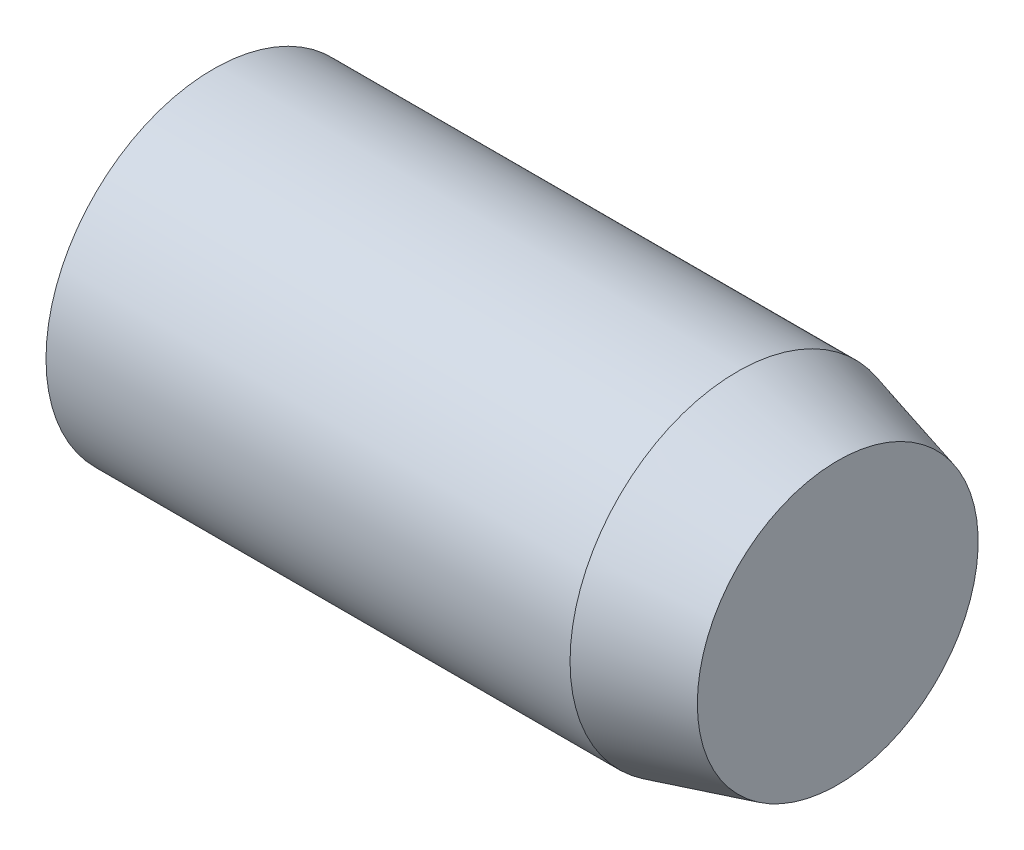
ISO-10303-21;
HEADER;
FILE_DESCRIPTION(('STEP AP214'),'2;1');
FILE_NAME('part.step','',(''),(''),'','','');
FILE_SCHEMA(('AUTOMOTIVE_DESIGN { 1 0 10303 214 1 1 1 1 }'));
ENDSEC;
DATA;
#1=APPLICATION_CONTEXT('core data for automotive mechanical design processes');
#2=APPLICATION_PROTOCOL_DEFINITION('international standard','automotive_design',2000,#1);
#3=PRODUCT_CONTEXT('',#1,'mechanical');
#4=PRODUCT('Part','Part','',(#3));
#5=PRODUCT_RELATED_PRODUCT_CATEGORY('part','',(#4));
#6=PRODUCT_DEFINITION_FORMATION('','',#4);
#7=PRODUCT_DEFINITION_CONTEXT('part definition',#1,'design');
#8=PRODUCT_DEFINITION('design','',#6,#7);
#9=PRODUCT_DEFINITION_SHAPE('','',#8);
#10=(LENGTH_UNIT() NAMED_UNIT(*) SI_UNIT(.MILLI.,.METRE.));
#11=(NAMED_UNIT(*) PLANE_ANGLE_UNIT() SI_UNIT($,.RADIAN.));
#12=(NAMED_UNIT(*) SI_UNIT($,.STERADIAN.) SOLID_ANGLE_UNIT());
#13=UNCERTAINTY_MEASURE_WITH_UNIT(LENGTH_MEASURE(1.E-05),#10,'distance_accuracy_value','');
#14=(GEOMETRIC_REPRESENTATION_CONTEXT(3) GLOBAL_UNCERTAINTY_ASSIGNED_CONTEXT((#13)) GLOBAL_UNIT_ASSIGNED_CONTEXT((#10,
#11,#12)) REPRESENTATION_CONTEXT('',''));
#15=CARTESIAN_POINT('',(0.,0.,0.));
#16=DIRECTION('',(0.,0.,1.));
#17=DIRECTION('',(1.,0.,0.));
#18=AXIS2_PLACEMENT_3D('',#15,#16,#17);
#19=CARTESIAN_POINT('',(0.,0.,0.));
#20=DIRECTION('',(-1.,0.,0.));
#21=DIRECTION('',(0.,0.,1.));
#22=AXIS2_PLACEMENT_3D('',#19,#20,#21);
#23=PLANE('',#22);
#24=CARTESIAN_POINT('',(0.,0.,0.));
#25=DIRECTION('',(-1.,0.,0.));
#26=DIRECTION('',(0.,0.,1.));
#27=AXIS2_PLACEMENT_3D('',#24,#25,#26);
#28=CIRCLE('',#27,2.09807621132745);
#29=CARTESIAN_POINT('',(0.,0.,2.09807621132745));
#30=VERTEX_POINT('',#29);
#31=EDGE_CURVE('E19',#30,#30,#28,.T.);
#32=ORIENTED_EDGE('',*,*,#31,.F.);
#33=EDGE_LOOP('',(#32));
#34=FACE_BOUND('',#33,.T.);
#35=ADVANCED_FACE('F16',(#34),#23,.F.);
#36=CARTESIAN_POINT('',(-1.49999999990769,0.,0.));
#37=DIRECTION('',(-1.,0.,0.));
#38=DIRECTION('',(0.,0.,1.));
#39=AXIS2_PLACEMENT_3D('',#36,#37,#38);
#40=CONICAL_SURFACE('',#39,2.4999999999693,0.261799387811533);
#41=CARTESIAN_POINT('',(-1.49999999999997,0.,0.));
#42=DIRECTION('',(-1.,0.,0.));
#43=DIRECTION('',(0.,0.,1.));
#44=AXIS2_PLACEMENT_3D('',#41,#42,#43);
#45=CIRCLE('',#44,2.5);
#46=CARTESIAN_POINT('',(-1.49999999999997,0.,2.5));
#47=VERTEX_POINT('',#46);
#48=EDGE_CURVE('E24',#47,#47,#45,.T.);
#49=ORIENTED_EDGE('',*,*,#48,.F.);
#50=EDGE_LOOP('',(#49));
#51=FACE_BOUND('',#50,.T.);
#52=ORIENTED_EDGE('',*,*,#31,.T.);
#53=EDGE_LOOP('',(#52));
#54=FACE_BOUND('',#53,.T.);
#55=ADVANCED_FACE('F37',(#51,#54),#40,.T.);
#56=CARTESIAN_POINT('',(-5.,0.,0.));
#57=DIRECTION('',(0.,1.,0.));
#58=DIRECTION('',(1.,0.,0.));
#59=AXIS2_PLACEMENT_3D('',#56,#57,#58);
#60=SPHERICAL_SURFACE('',#59,5.);
#61=CARTESIAN_POINT('',(-9.33012701892219,0.,0.));
#62=DIRECTION('',(-1.,0.,0.));
#63=DIRECTION('',(0.,0.,1.));
#64=AXIS2_PLACEMENT_3D('',#61,#62,#63);
#65=CIRCLE('',#64,2.5);
#66=CARTESIAN_POINT('',(-9.33012701892219,0.,2.5));
#67=VERTEX_POINT('',#66);
#68=EDGE_CURVE('E10',#67,#67,#65,.F.);
#69=ORIENTED_EDGE('',*,*,#68,.F.);
#70=EDGE_LOOP('',(#69));
#71=FACE_BOUND('',#70,.T.);
#72=ADVANCED_FACE('F33',(#71),#60,.T.);
#73=CARTESIAN_POINT('',(-60.0052434362964,0.,0.));
#74=DIRECTION('',(-1.,0.,0.));
#75=DIRECTION('',(0.,0.,1.));
#76=AXIS2_PLACEMENT_3D('',#73,#74,#75);
#77=CYLINDRICAL_SURFACE('',#76,2.5);
#78=ORIENTED_EDGE('',*,*,#68,.T.);
#79=EDGE_LOOP('',(#78));
#80=FACE_BOUND('',#79,.T.);
#81=ORIENTED_EDGE('',*,*,#48,.T.);
#82=EDGE_LOOP('',(#81));
#83=FACE_BOUND('',#82,.T.);
#84=ADVANCED_FACE('F36',(#80,#83),#77,.T.);
#85=CLOSED_SHELL('',(#35,#55,#72,#84));
#86=MANIFOLD_SOLID_BREP('B1',#85);
#87=ADVANCED_BREP_SHAPE_REPRESENTATION('',(#18,#86),#14);
#88=SHAPE_DEFINITION_REPRESENTATION(#9,#87);
ENDSEC;
END-ISO-10303-21;
